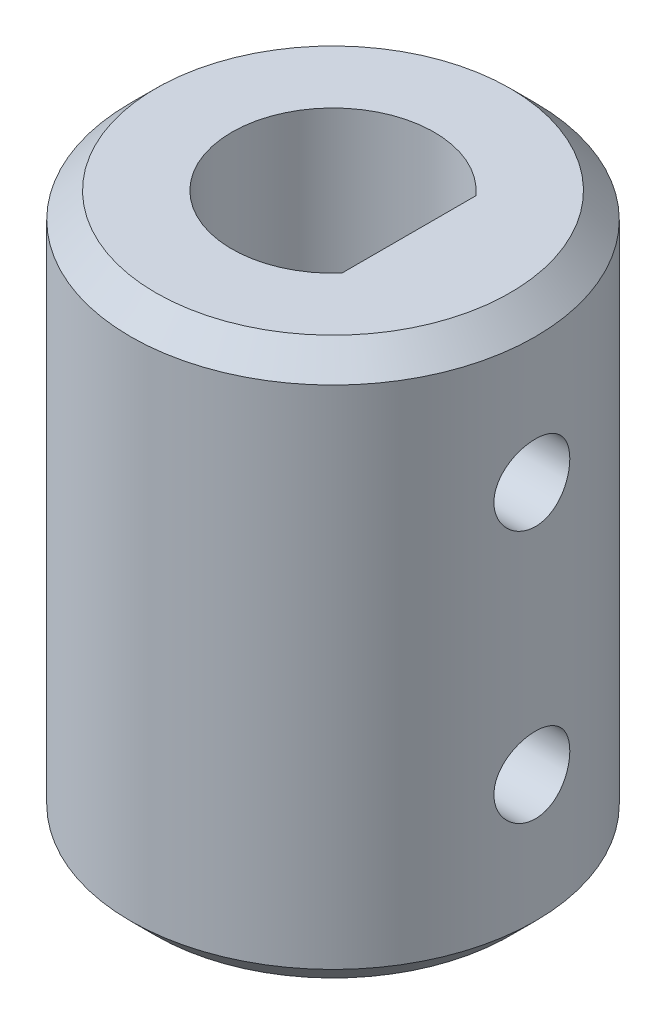
ISO-10303-21;
HEADER;
FILE_DESCRIPTION(('STEP AP214'),'2;1');
FILE_NAME('part.step','',(''),(''),'','','');
FILE_SCHEMA(('AUTOMOTIVE_DESIGN { 1 0 10303 214 1 1 1 1 }'));
ENDSEC;
DATA;
#1=APPLICATION_CONTEXT('core data for automotive mechanical design processes');
#2=APPLICATION_PROTOCOL_DEFINITION('international standard','automotive_design',2000,#1);
#3=PRODUCT_CONTEXT('',#1,'mechanical');
#4=PRODUCT('Part','Part','',(#3));
#5=PRODUCT_RELATED_PRODUCT_CATEGORY('part','',(#4));
#6=PRODUCT_DEFINITION_FORMATION('','',#4);
#7=PRODUCT_DEFINITION_CONTEXT('part definition',#1,'design');
#8=PRODUCT_DEFINITION('design','',#6,#7);
#9=PRODUCT_DEFINITION_SHAPE('','',#8);
#10=(LENGTH_UNIT() NAMED_UNIT(*) SI_UNIT(.MILLI.,.METRE.));
#11=(NAMED_UNIT(*) PLANE_ANGLE_UNIT() SI_UNIT($,.RADIAN.));
#12=(NAMED_UNIT(*) SI_UNIT($,.STERADIAN.) SOLID_ANGLE_UNIT());
#13=UNCERTAINTY_MEASURE_WITH_UNIT(LENGTH_MEASURE(1.E-05),#10,'distance_accuracy_value','');
#14=(GEOMETRIC_REPRESENTATION_CONTEXT(3) GLOBAL_UNCERTAINTY_ASSIGNED_CONTEXT((#13)) GLOBAL_UNIT_ASSIGNED_CONTEXT((#10,
#11,#12)) REPRESENTATION_CONTEXT('',''));
#15=CARTESIAN_POINT('',(0.,0.,0.));
#16=DIRECTION('',(0.,0.,1.));
#17=DIRECTION('',(1.,0.,0.));
#18=AXIS2_PLACEMENT_3D('',#15,#16,#17);
#19=CARTESIAN_POINT('',(0.,22.,0.));
#20=DIRECTION('',(0.,-1.,0.));
#21=DIRECTION('',(0.,0.,-1.));
#22=AXIS2_PLACEMENT_3D('',#19,#20,#21);
#23=CYLINDRICAL_SURFACE('',#22,8.);
#24=CARTESIAN_POINT('',(7.85811682275086,5.99999999999999,-1.5));
#25=CARTESIAN_POINT('',(7.85811843793493,6.08345720801173,-1.49999679883246));
#26=CARTESIAN_POINT('',(7.85946079760266,6.16695594821838,-1.49301126348936));
#27=CARTESIAN_POINT('',(7.86467851014364,6.3315989615819,-1.46527253251805));
#28=CARTESIAN_POINT('',(7.86855601173205,6.41274117642747,-1.44450765768477));
#29=CARTESIAN_POINT('',(7.87838976464885,6.57026507137087,-1.38987035617788));
#30=CARTESIAN_POINT('',(7.88434407905997,6.64665110930728,-1.35601013954374));
#31=CARTESIAN_POINT('',(7.89765826320959,6.7926535592868,-1.27617565760366));
#32=CARTESIAN_POINT('',(7.90501802325622,6.86227049900329,-1.23020233759193));
#33=CARTESIAN_POINT('',(7.92041614838944,6.99363019919912,-1.12683678942623));
#34=CARTESIAN_POINT('',(7.92846116625679,7.05527648347172,-1.06932292933092));
#35=CARTESIAN_POINT('',(7.94426457664034,7.16810438959955,-0.944771778803553));
#36=CARTESIAN_POINT('',(7.95202295031153,7.21928532442478,-0.877733863624946));
#37=CARTESIAN_POINT('',(7.96645017828405,7.31009937660051,-0.735403894570164));
#38=CARTESIAN_POINT('',(7.97311028052363,7.34964153351941,-0.660052840033867));
#39=CARTESIAN_POINT('',(7.9845160863293,7.41546954227352,-0.503631283250764));
#40=CARTESIAN_POINT('',(7.98926194728334,7.44175648399021,-0.422561251859507));
#41=CARTESIAN_POINT('',(7.99625755123778,7.48002954861113,-0.258002746187418));
#42=CARTESIAN_POINT('',(7.99853565976327,7.49217830592268,-0.174553323244859));
#43=CARTESIAN_POINT('',(8.00043684615594,7.50233688770039,-0.00677167603538497));
#44=CARTESIAN_POINT('',(8.00006015010697,7.50034791613905,0.0775604724476684));
#45=CARTESIAN_POINT('',(7.99671633763241,7.48241222885284,0.243598357899395));
#46=CARTESIAN_POINT('',(7.99378172247214,7.46664063056998,0.325323760451467));
#47=CARTESIAN_POINT('',(7.98568826333561,7.42186435060475,0.484947165715474));
#48=CARTESIAN_POINT('',(7.98052933829966,7.39285918665419,0.562845028826539));
#49=CARTESIAN_POINT('',(7.96851260297339,7.32227226894169,0.71311006575152));
#50=CARTESIAN_POINT('',(7.96164537590825,7.2806205120875,0.785443571838532));
#51=CARTESIAN_POINT('',(7.9469714754285,7.18597433092284,0.922159977214637));
#52=CARTESIAN_POINT('',(7.93916470651164,7.13297875311241,0.986542066910783));
#53=CARTESIAN_POINT('',(7.92333513680567,7.01618429701646,1.10656561896904));
#54=CARTESIAN_POINT('',(7.91531085901622,6.95223221609792,1.16205790757041));
#55=CARTESIAN_POINT('',(7.90006508924621,6.81585046872137,1.2615517185126));
#56=CARTESIAN_POINT('',(7.89284360901351,6.74342067823536,1.30555307271182));
#57=CARTESIAN_POINT('',(7.88001893307121,6.59194172929733,1.38085852224478));
#58=CARTESIAN_POINT('',(7.87441850530261,6.51288154280935,1.41214093645421));
#59=CARTESIAN_POINT('',(7.86551242396689,6.35049881587679,1.46093656975056));
#60=CARTESIAN_POINT('',(7.8622065103862,6.26717675953521,1.47845134901108));
#61=CARTESIAN_POINT('',(7.85831520301005,6.09998067114411,1.49899672649739));
#62=CARTESIAN_POINT('',(7.85768955816137,6.01613388443448,1.50224164285859));
#63=CARTESIAN_POINT('',(7.8591219142084,5.84909654491284,1.49472968881724));
#64=CARTESIAN_POINT('',(7.86117978238611,5.76590595985191,1.48397351086433));
#65=CARTESIAN_POINT('',(7.86770980063205,5.6032470969456,1.44894868195883));
#66=CARTESIAN_POINT('',(7.87216186690878,5.5237537473751,1.4247923858399));
#67=CARTESIAN_POINT('',(7.88296134156618,5.36994281026983,1.3637722437906));
#68=CARTESIAN_POINT('',(7.88930888963281,5.29562560468466,1.32690746128795));
#69=CARTESIAN_POINT('',(7.90327577863685,5.15333238095682,1.2410235311966));
#70=CARTESIAN_POINT('',(7.91090895425315,5.08543946213392,1.19186899639621));
#71=CARTESIAN_POINT('',(7.926548113681,4.95878795978566,1.08298344344247));
#72=CARTESIAN_POINT('',(7.93455413096494,4.90003019844422,1.02325147433084));
#73=CARTESIAN_POINT('',(7.95016624005946,4.79251623646587,0.893949417870386));
#74=CARTESIAN_POINT('',(7.95776555833305,4.74390417339403,0.824258534095891));
#75=CARTESIAN_POINT('',(7.97159404810351,4.65907879382233,0.677574523040141));
#76=CARTESIAN_POINT('',(7.97782327234725,4.62286499997499,0.600581677038529));
#77=CARTESIAN_POINT('',(7.98818057995848,4.56407990213591,0.441877541578684));
#78=CARTESIAN_POINT('',(7.99231954730142,4.54143781243858,0.360193213078988));
#79=CARTESIAN_POINT('',(7.99807642083745,4.51021295171011,0.19409622738157));
#80=CARTESIAN_POINT('',(7.99969459229933,4.50162870133728,0.109683858215851));
#81=CARTESIAN_POINT('',(8.00022227515441,4.49881469848155,-0.0580907602505096));
#82=CARTESIAN_POINT('',(7.99917286625032,4.50436724687046,-0.141449307066269));
#83=CARTESIAN_POINT('',(7.99456866611703,4.52919242776843,-0.3060233692792));
#84=CARTESIAN_POINT('',(7.99101389890671,4.5484649287442,-0.38723890521369));
#85=CARTESIAN_POINT('',(7.98179837978045,4.60009120738371,-0.545106475595485));
#86=CARTESIAN_POINT('',(7.97614135981576,4.632421812881,-0.621766319318224));
#87=CARTESIAN_POINT('',(7.96333372068771,4.70922045365517,-0.768605631316694));
#88=CARTESIAN_POINT('',(7.95618300146483,4.75368930210664,-0.838784665003271));
#89=CARTESIAN_POINT('',(7.94104779859941,4.85425145444231,-0.971755027780007));
#90=CARTESIAN_POINT('',(7.93305284591272,4.9105020338617,-1.03442623539053));
#91=CARTESIAN_POINT('',(7.91719633538833,5.0327045624927,-1.14951536065485));
#92=CARTESIAN_POINT('',(7.90933480936765,5.09865879037371,-1.2019308632478));
#93=CARTESIAN_POINT('',(7.89455577425926,5.23912645470334,-1.29547633945385));
#94=CARTESIAN_POINT('',(7.88764767280729,5.31371343966763,-1.33649740531872));
#95=CARTESIAN_POINT('',(7.87567084650033,5.46882578997973,-1.40536132423417));
#96=CARTESIAN_POINT('',(7.87060038649116,5.54934546658937,-1.43321661638912));
#97=CARTESIAN_POINT('',(7.86393016292125,5.6917522880659,-1.46929726596175));
#98=CARTESIAN_POINT('',(7.86176310717932,5.75280572376194,-1.48079105739851));
#99=CARTESIAN_POINT('',(7.85885585595504,5.87589846842031,-1.49614351076215));
#100=CARTESIAN_POINT('',(7.85811562163283,5.93793775050032,-1.50000238052127));
#101=CARTESIAN_POINT('',(7.85811682275086,5.99999999999999,-1.5));
#102=B_SPLINE_CURVE_WITH_KNOTS('',3,(#24,#25,#26,#27,#28,#29,#30,#31,#32,#33,#34,#35,#36,#37,
#38,#39,#40,#41,#42,#43,#44,#45,#46,#47,#48,#49,#50,#51,#52,#53,#54,#55,#56,#57,#58,#59,#60,#61,
#62,#63,#64,#65,#66,#67,#68,#69,#70,#71,#72,#73,#74,#75,#76,#77,#78,#79,#80,#81,#82,#83,#84,#85,
#86,#87,#88,#89,#90,#91,#92,#93,#94,#95,#96,#97,#98,#99,#100,#101),.UNSPECIFIED.,.T.,.F.,(4,2,2,
2,2,2,2,2,2,2,2,2,2,2,2,2,2,2,2,2,2,2,2,2,2,2,2,2,2,2,2,2,2,2,2,2,2,2,4),(0.,0.250144505793186,
0.500501302380392,0.750625227978432,1.00072963993908,1.25362335698691,1.50653367069315,
1.76137104348047,2.0161874593964,2.26804275460261,2.51987660200648,2.76855650598724,
3.01724547328424,3.26733691984219,3.51745380911785,3.77140614764064,4.025362201924,
4.27974936118266,4.53410768866488,4.78463248587075,5.03514489338718,5.28358792315369,
5.53204926624317,5.78337862654143,6.03473059394677,6.28944125495871,6.54414210821705,
6.79750269418683,7.0508366166733,7.30029300570138,7.54974700322167,7.79876026530358,
8.0477902135711,8.30038464008745,8.55303847730765,8.80803001818118,9.06278015749119,
9.24880307527215,9.43482092920425),.UNSPECIFIED.);
#103=CARTESIAN_POINT('',(7.85811682275086,5.99999999999999,-1.5));
#104=VERTEX_POINT('',#103);
#105=EDGE_CURVE('E130',#104,#104,#102,.T.);
#106=ORIENTED_EDGE('',*,*,#105,.F.);
#107=EDGE_LOOP('',(#106));
#108=FACE_BOUND('',#107,.T.);
#109=CARTESIAN_POINT('',(7.85811682275086,16.,-1.5));
#110=CARTESIAN_POINT('',(7.85811843793493,16.0834572080117,-1.49999679883246));
#111=CARTESIAN_POINT('',(7.85946079760266,16.1669559482184,-1.49301126348936));
#112=CARTESIAN_POINT('',(7.86467851014364,16.3315989615819,-1.46527253251805));
#113=CARTESIAN_POINT('',(7.86855601173205,16.4127411764275,-1.44450765768477));
#114=CARTESIAN_POINT('',(7.87838976464885,16.5702650713709,-1.38987035617788));
#115=CARTESIAN_POINT('',(7.88434407905997,16.6466511093073,-1.35601013954374));
#116=CARTESIAN_POINT('',(7.89765826320959,16.7926535592868,-1.27617565760366));
#117=CARTESIAN_POINT('',(7.90501802325622,16.8622704990033,-1.23020233759193));
#118=CARTESIAN_POINT('',(7.92041614838944,16.9936301991991,-1.12683678942623));
#119=CARTESIAN_POINT('',(7.92846116625679,17.0552764834717,-1.06932292933092));
#120=CARTESIAN_POINT('',(7.94426457664034,17.1681043895996,-0.944771778803554));
#121=CARTESIAN_POINT('',(7.95202295031153,17.2192853244248,-0.877733863624947));
#122=CARTESIAN_POINT('',(7.96645017828405,17.3100993766005,-0.735403894570164));
#123=CARTESIAN_POINT('',(7.97311028052363,17.3496415335194,-0.660052840033867));
#124=CARTESIAN_POINT('',(7.9845160863293,17.4154695422735,-0.503631283250763));
#125=CARTESIAN_POINT('',(7.98926194728334,17.4417564839902,-0.422561251859506));
#126=CARTESIAN_POINT('',(7.99625755123778,17.4800295486111,-0.258002746187416));
#127=CARTESIAN_POINT('',(7.99853565976327,17.4921783059227,-0.174553323244857));
#128=CARTESIAN_POINT('',(8.00043684615594,17.5023368877004,-0.0067716760353836));
#129=CARTESIAN_POINT('',(8.00006015010697,17.5003479161391,0.0775604724476695));
#130=CARTESIAN_POINT('',(7.99671633763241,17.4824122288528,0.243598357899396));
#131=CARTESIAN_POINT('',(7.99378172247214,17.46664063057,0.325323760451469));
#132=CARTESIAN_POINT('',(7.98568826333561,17.4218643506048,0.484947165715475));
#133=CARTESIAN_POINT('',(7.98052933829966,17.3928591866542,0.56284502882654));
#134=CARTESIAN_POINT('',(7.96851260297339,17.3222722689417,0.71311006575152));
#135=CARTESIAN_POINT('',(7.96164537590825,17.2806205120875,0.785443571838532));
#136=CARTESIAN_POINT('',(7.9469714754285,17.1859743309228,0.922159977214638));
#137=CARTESIAN_POINT('',(7.93916470651164,17.1329787531124,0.986542066910785));
#138=CARTESIAN_POINT('',(7.92333513680567,17.0161842970165,1.10656561896904));
#139=CARTESIAN_POINT('',(7.91531085901622,16.9522322160979,1.16205790757041));
#140=CARTESIAN_POINT('',(7.90006508924621,16.8158504687214,1.2615517185126));
#141=CARTESIAN_POINT('',(7.89284360901351,16.7434206782354,1.30555307271182));
#142=CARTESIAN_POINT('',(7.88001893307121,16.5919417292973,1.38085852224478));
#143=CARTESIAN_POINT('',(7.87441850530261,16.5128815428094,1.41214093645421));
#144=CARTESIAN_POINT('',(7.86551242396689,16.3504988158768,1.46093656975056));
#145=CARTESIAN_POINT('',(7.8622065103862,16.2671767595352,1.47845134901108));
#146=CARTESIAN_POINT('',(7.85831520301005,16.0999806711441,1.49899672649739));
#147=CARTESIAN_POINT('',(7.85768955816137,16.0161338844345,1.50224164285859));
#148=CARTESIAN_POINT('',(7.8591219142084,15.8490965449129,1.49472968881724));
#149=CARTESIAN_POINT('',(7.86117978238611,15.7659059598519,1.48397351086433));
#150=CARTESIAN_POINT('',(7.86770980063205,15.6032470969456,1.44894868195883));
#151=CARTESIAN_POINT('',(7.87216186690878,15.5237537473751,1.4247923858399));
#152=CARTESIAN_POINT('',(7.88296134156619,15.3699428102698,1.3637722437906));
#153=CARTESIAN_POINT('',(7.88930888963281,15.2956256046847,1.32690746128795));
#154=CARTESIAN_POINT('',(7.90327577863685,15.1533323809568,1.2410235311966));
#155=CARTESIAN_POINT('',(7.91090895425315,15.0854394621339,1.19186899639621));
#156=CARTESIAN_POINT('',(7.926548113681,14.9587879597857,1.08298344344247));
#157=CARTESIAN_POINT('',(7.93455413096494,14.9000301984442,1.02325147433084));
#158=CARTESIAN_POINT('',(7.95016624005946,14.7925162364659,0.893949417870386));
#159=CARTESIAN_POINT('',(7.95776555833305,14.743904173394,0.82425853409589));
#160=CARTESIAN_POINT('',(7.97159404810351,14.6590787938223,0.67757452304014));
#161=CARTESIAN_POINT('',(7.97782327234725,14.622864999975,0.600581677038528));
#162=CARTESIAN_POINT('',(7.98818057995848,14.5640799021359,0.441877541578684));
#163=CARTESIAN_POINT('',(7.99231954730142,14.5414378124386,0.360193213078987));
#164=CARTESIAN_POINT('',(7.99807642083745,14.5102129517101,0.19409622738157));
#165=CARTESIAN_POINT('',(7.99969459229933,14.5016287013373,0.109683858215851));
#166=CARTESIAN_POINT('',(8.00022227515441,14.4988146984816,-0.0580907602505097));
#167=CARTESIAN_POINT('',(7.99917286625032,14.5043672468705,-0.141449307066269));
#168=CARTESIAN_POINT('',(7.99456866611703,14.5291924277684,-0.3060233692792));
#169=CARTESIAN_POINT('',(7.99101389890671,14.5484649287442,-0.38723890521369));
#170=CARTESIAN_POINT('',(7.98179837978045,14.6000912073837,-0.545106475595485));
#171=CARTESIAN_POINT('',(7.97614135981576,14.632421812881,-0.621766319318223));
#172=CARTESIAN_POINT('',(7.96333372068771,14.7092204536552,-0.768605631316694));
#173=CARTESIAN_POINT('',(7.95618300146483,14.7536893021067,-0.838784665003272));
#174=CARTESIAN_POINT('',(7.94104779859941,14.8542514544423,-0.971755027780007));
#175=CARTESIAN_POINT('',(7.93305284591272,14.9105020338617,-1.03442623539053));
#176=CARTESIAN_POINT('',(7.91719633538833,15.0327045624927,-1.14951536065485));
#177=CARTESIAN_POINT('',(7.90933480936765,15.0986587903737,-1.2019308632478));
#178=CARTESIAN_POINT('',(7.89455577425926,15.2391264547033,-1.29547633945385));
#179=CARTESIAN_POINT('',(7.88764767280729,15.3137134396676,-1.33649740531872));
#180=CARTESIAN_POINT('',(7.87567084650033,15.4688257899797,-1.40536132423417));
#181=CARTESIAN_POINT('',(7.87060038649116,15.5493454665894,-1.43321661638912));
#182=CARTESIAN_POINT('',(7.86393016292125,15.6917522880659,-1.46929726596176));
#183=CARTESIAN_POINT('',(7.86176310717932,15.7528057237619,-1.48079105739851));
#184=CARTESIAN_POINT('',(7.85885585595504,15.8758984684203,-1.49614351076215));
#185=CARTESIAN_POINT('',(7.85811562163283,15.9379377505003,-1.50000238052127));
#186=CARTESIAN_POINT('',(7.85811682275086,16.,-1.5));
#187=B_SPLINE_CURVE_WITH_KNOTS('',3,(#109,#110,#111,#112,#113,#114,#115,#116,#117,#118,#119,
#120,#121,#122,#123,#124,#125,#126,#127,#128,#129,#130,#131,#132,#133,#134,#135,#136,#137,#138,
#139,#140,#141,#142,#143,#144,#145,#146,#147,#148,#149,#150,#151,#152,#153,#154,#155,#156,#157,
#158,#159,#160,#161,#162,#163,#164,#165,#166,#167,#168,#169,#170,#171,#172,#173,#174,#175,#176,
#177,#178,#179,#180,#181,#182,#183,#184,#185,#186),.UNSPECIFIED.,.T.,.F.,(4,2,2,2,2,2,2,2,2,2,2,
2,2,2,2,2,2,2,2,2,2,2,2,2,2,2,2,2,2,2,2,2,2,2,2,2,2,2,4),(0.,0.250144505793185,
0.500501302380392,0.75062522797843,1.00072963993908,1.25362335698691,1.50653367069315,
1.76137104348047,2.0161874593964,2.26804275460261,2.51987660200648,2.76855650598725,
3.01724547328425,3.26733691984219,3.51745380911786,3.77140614764064,4.025362201924,
4.27974936118266,4.53410768866488,4.78463248587075,5.03514489338718,5.28358792315369,
5.53204926624317,5.78337862654144,6.03473059394677,6.28944125495871,6.54414210821705,
6.79750269418683,7.0508366166733,7.30029300570138,7.54974700322167,7.79876026530358,
8.0477902135711,8.30038464008745,8.55303847730765,8.80803001818118,9.06278015749119,
9.24880307527215,9.43482092920425),.UNSPECIFIED.);
#188=CARTESIAN_POINT('',(7.85811682275086,16.,-1.5));
#189=VERTEX_POINT('',#188);
#190=EDGE_CURVE('E71',#189,#189,#187,.T.);
#191=ORIENTED_EDGE('',*,*,#190,.F.);
#192=EDGE_LOOP('',(#191));
#193=FACE_BOUND('',#192,.T.);
#194=CARTESIAN_POINT('',(0.,1.,0.));
#195=DIRECTION('',(0.,1.,0.));
#196=DIRECTION('',(0.,0.,1.));
#197=AXIS2_PLACEMENT_3D('',#194,#195,#196);
#198=CIRCLE('',#197,8.);
#199=CARTESIAN_POINT('',(0.,1.,8.));
#200=VERTEX_POINT('',#199);
#201=EDGE_CURVE('E82',#200,#200,#198,.T.);
#202=ORIENTED_EDGE('',*,*,#201,.T.);
#203=EDGE_LOOP('',(#202));
#204=FACE_BOUND('',#203,.T.);
#205=CARTESIAN_POINT('',(0.,21.,0.));
#206=DIRECTION('',(0.,1.,0.));
#207=DIRECTION('',(0.,0.,1.));
#208=AXIS2_PLACEMENT_3D('',#205,#206,#207);
#209=CIRCLE('',#208,8.);
#210=CARTESIAN_POINT('',(0.,21.,8.));
#211=VERTEX_POINT('',#210);
#212=EDGE_CURVE('E66',#211,#211,#209,.F.);
#213=ORIENTED_EDGE('',*,*,#212,.T.);
#214=EDGE_LOOP('',(#213));
#215=FACE_BOUND('',#214,.T.);
#216=ADVANCED_FACE('F32',(#108,#193,#204,#215),#23,.T.);
#217=CARTESIAN_POINT('',(0.,22.,0.));
#218=DIRECTION('',(0.,1.,0.));
#219=DIRECTION('',(0.,0.,1.));
#220=AXIS2_PLACEMENT_3D('',#217,#218,#219);
#221=PLANE('',#220);
#222=CARTESIAN_POINT('',(0.,22.,0.));
#223=DIRECTION('',(0.,1.,0.));
#224=DIRECTION('',(0.,0.,1.));
#225=AXIS2_PLACEMENT_3D('',#222,#223,#224);
#226=CIRCLE('',#225,6.99999999999999);
#227=CARTESIAN_POINT('',(0.,22.,6.99999999999999));
#228=VERTEX_POINT('',#227);
#229=EDGE_CURVE('E11',#228,#228,#226,.T.);
#230=ORIENTED_EDGE('',*,*,#229,.T.);
#231=EDGE_LOOP('',(#230));
#232=FACE_BOUND('',#231,.T.);
#233=DIRECTION('',(0.,0.,-1.));
#234=VECTOR('',#233,1.);
#235=CARTESIAN_POINT('',(3.,22.,-2.64575131106459));
#236=LINE('',#235,#234);
#237=CARTESIAN_POINT('',(3.,22.,2.64575131106459));
#238=VERTEX_POINT('',#237);
#239=CARTESIAN_POINT('',(3.,22.,-2.64575131106459));
#240=VERTEX_POINT('',#239);
#241=EDGE_CURVE('E62',#238,#240,#236,.T.);
#242=ORIENTED_EDGE('',*,*,#241,.F.);
#243=CARTESIAN_POINT('',(0.,22.,0.));
#244=DIRECTION('',(0.,1.,0.));
#245=DIRECTION('',(0.,0.,-1.));
#246=AXIS2_PLACEMENT_3D('',#243,#244,#245);
#247=CIRCLE('',#246,4.);
#248=EDGE_CURVE('E68',#240,#238,#247,.T.);
#249=ORIENTED_EDGE('',*,*,#248,.F.);
#250=EDGE_LOOP('',(#242,#249));
#251=FACE_BOUND('',#250,.T.);
#252=ADVANCED_FACE('F73',(#232,#251),#221,.T.);
#253=CARTESIAN_POINT('',(0.,0.,0.));
#254=DIRECTION('',(0.,1.,0.));
#255=DIRECTION('',(0.,0.,1.));
#256=AXIS2_PLACEMENT_3D('',#253,#254,#255);
#257=PLANE('',#256);
#258=CARTESIAN_POINT('',(0.,0.,0.));
#259=DIRECTION('',(0.,1.,0.));
#260=DIRECTION('',(0.,0.,1.));
#261=AXIS2_PLACEMENT_3D('',#258,#259,#260);
#262=CIRCLE('',#261,7.);
#263=CARTESIAN_POINT('',(0.,0.,7.));
#264=VERTEX_POINT('',#263);
#265=EDGE_CURVE('E40',#264,#264,#262,.F.);
#266=ORIENTED_EDGE('',*,*,#265,.T.);
#267=EDGE_LOOP('',(#266));
#268=FACE_BOUND('',#267,.T.);
#269=DIRECTION('',(0.,0.,-1.));
#270=VECTOR('',#269,1.);
#271=CARTESIAN_POINT('',(3.,0.,2.64575131106459));
#272=LINE('',#271,#270);
#273=CARTESIAN_POINT('',(3.,0.,2.64575131106459));
#274=VERTEX_POINT('',#273);
#275=CARTESIAN_POINT('',(3.,0.,-2.64575131106459));
#276=VERTEX_POINT('',#275);
#277=EDGE_CURVE('E65',#274,#276,#272,.T.);
#278=ORIENTED_EDGE('',*,*,#277,.T.);
#279=CARTESIAN_POINT('',(0.,0.,0.));
#280=DIRECTION('',(0.,-1.,0.));
#281=DIRECTION('',(0.,0.,-1.));
#282=AXIS2_PLACEMENT_3D('',#279,#280,#281);
#283=CIRCLE('',#282,4.);
#284=EDGE_CURVE('E52',#274,#276,#283,.T.);
#285=ORIENTED_EDGE('',*,*,#284,.F.);
#286=EDGE_LOOP('',(#278,#285));
#287=FACE_BOUND('',#286,.T.);
#288=ADVANCED_FACE('F87',(#268,#287),#257,.F.);
#289=CARTESIAN_POINT('',(0.,12.,0.));
#290=DIRECTION('',(0.,-1.,0.));
#291=DIRECTION('',(0.,0.,-1.));
#292=AXIS2_PLACEMENT_3D('',#289,#290,#291);
#293=CYLINDRICAL_SURFACE('',#292,4.);
#294=ORIENTED_EDGE('',*,*,#284,.T.);
#295=DIRECTION('',(0.,-1.,0.));
#296=VECTOR('',#295,1.);
#297=CARTESIAN_POINT('',(3.,12.,-2.64575131106459));
#298=LINE('',#297,#296);
#299=EDGE_CURVE('E47',#240,#276,#298,.T.);
#300=ORIENTED_EDGE('',*,*,#299,.F.);
#301=ORIENTED_EDGE('',*,*,#248,.T.);
#302=DIRECTION('',(0.,-1.,0.));
#303=VECTOR('',#302,1.);
#304=CARTESIAN_POINT('',(3.,12.,2.64575131106459));
#305=LINE('',#304,#303);
#306=EDGE_CURVE('E59',#238,#274,#305,.T.);
#307=ORIENTED_EDGE('',*,*,#306,.T.);
#308=EDGE_LOOP('',(#294,#300,#301,#307));
#309=FACE_BOUND('',#308,.T.);
#310=ADVANCED_FACE('F69',(#309),#293,.F.);
#311=CARTESIAN_POINT('',(3.,12.,2.64575131106459));
#312=DIRECTION('',(-1.,0.,0.));
#313=DIRECTION('',(0.,0.,1.));
#314=AXIS2_PLACEMENT_3D('',#311,#312,#313);
#315=PLANE('',#314);
#316=CARTESIAN_POINT('',(3.,5.99999999999999,0.));
#317=DIRECTION('',(-1.,0.,0.));
#318=DIRECTION('',(0.,0.,1.));
#319=AXIS2_PLACEMENT_3D('',#316,#317,#318);
#320=CIRCLE('',#319,1.5);
#321=CARTESIAN_POINT('',(3.,5.99999999999999,1.5));
#322=VERTEX_POINT('',#321);
#323=EDGE_CURVE('E136',#322,#322,#320,.F.);
#324=ORIENTED_EDGE('',*,*,#323,.T.);
#325=EDGE_LOOP('',(#324));
#326=FACE_BOUND('',#325,.T.);
#327=CARTESIAN_POINT('',(3.,16.,0.));
#328=DIRECTION('',(-1.,0.,0.));
#329=DIRECTION('',(0.,0.,1.));
#330=AXIS2_PLACEMENT_3D('',#327,#328,#329);
#331=CIRCLE('',#330,1.5);
#332=CARTESIAN_POINT('',(3.,16.,1.5));
#333=VERTEX_POINT('',#332);
#334=EDGE_CURVE('E127',#333,#333,#331,.F.);
#335=ORIENTED_EDGE('',*,*,#334,.T.);
#336=EDGE_LOOP('',(#335));
#337=FACE_BOUND('',#336,.T.);
#338=ORIENTED_EDGE('',*,*,#277,.F.);
#339=ORIENTED_EDGE('',*,*,#306,.F.);
#340=ORIENTED_EDGE('',*,*,#241,.T.);
#341=ORIENTED_EDGE('',*,*,#299,.T.);
#342=EDGE_LOOP('',(#338,#339,#340,#341));
#343=FACE_BOUND('',#342,.T.);
#344=ADVANCED_FACE('F60',(#326,#337,#343),#315,.T.);
#345=CARTESIAN_POINT('',(0.,1.,0.));
#346=DIRECTION('',(0.,1.,0.));
#347=DIRECTION('',(0.,0.,1.));
#348=AXIS2_PLACEMENT_3D('',#345,#346,#347);
#349=CONICAL_SURFACE('',#348,8.,0.78539816339745);
#350=ORIENTED_EDGE('',*,*,#265,.F.);
#351=EDGE_LOOP('',(#350));
#352=FACE_BOUND('',#351,.T.);
#353=ORIENTED_EDGE('',*,*,#201,.F.);
#354=EDGE_LOOP('',(#353));
#355=FACE_BOUND('',#354,.T.);
#356=ADVANCED_FACE('F90',(#352,#355),#349,.T.);
#357=CARTESIAN_POINT('',(0.,22.,0.));
#358=DIRECTION('',(0.,-1.,0.));
#359=DIRECTION('',(0.,0.,-1.));
#360=AXIS2_PLACEMENT_3D('',#357,#358,#359);
#361=CONICAL_SURFACE('',#360,6.99999999999999,0.785398163397448);
#362=ORIENTED_EDGE('',*,*,#212,.F.);
#363=EDGE_LOOP('',(#362));
#364=FACE_BOUND('',#363,.T.);
#365=ORIENTED_EDGE('',*,*,#229,.F.);
#366=EDGE_LOOP('',(#365));
#367=FACE_BOUND('',#366,.T.);
#368=ADVANCED_FACE('F34',(#364,#367),#361,.T.);
#369=CARTESIAN_POINT('',(-8.001,16.,0.));
#370=DIRECTION('',(1.,0.,0.));
#371=DIRECTION('',(0.,0.,-1.));
#372=AXIS2_PLACEMENT_3D('',#369,#370,#371);
#373=CYLINDRICAL_SURFACE('',#372,1.5);
#374=ORIENTED_EDGE('',*,*,#334,.F.);
#375=EDGE_LOOP('',(#374));
#376=FACE_BOUND('',#375,.T.);
#377=ORIENTED_EDGE('',*,*,#190,.T.);
#378=EDGE_LOOP('',(#377));
#379=FACE_BOUND('',#378,.T.);
#380=ADVANCED_FACE('F103',(#376,#379),#373,.F.);
#381=CARTESIAN_POINT('',(-8.001,5.99999999999999,0.));
#382=DIRECTION('',(1.,0.,0.));
#383=DIRECTION('',(0.,0.,-1.));
#384=AXIS2_PLACEMENT_3D('',#381,#382,#383);
#385=CYLINDRICAL_SURFACE('',#384,1.5);
#386=ORIENTED_EDGE('',*,*,#323,.F.);
#387=EDGE_LOOP('',(#386));
#388=FACE_BOUND('',#387,.T.);
#389=ORIENTED_EDGE('',*,*,#105,.T.);
#390=EDGE_LOOP('',(#389));
#391=FACE_BOUND('',#390,.T.);
#392=ADVANCED_FACE('F137',(#388,#391),#385,.F.);
#393=CLOSED_SHELL('',(#216,#252,#288,#310,#344,#356,#368,#380,#392));
#394=MANIFOLD_SOLID_BREP('B2',#393);
#395=ADVANCED_BREP_SHAPE_REPRESENTATION('',(#18,#394),#14);
#396=SHAPE_DEFINITION_REPRESENTATION(#9,#395);
ENDSEC;
END-ISO-10303-21;
